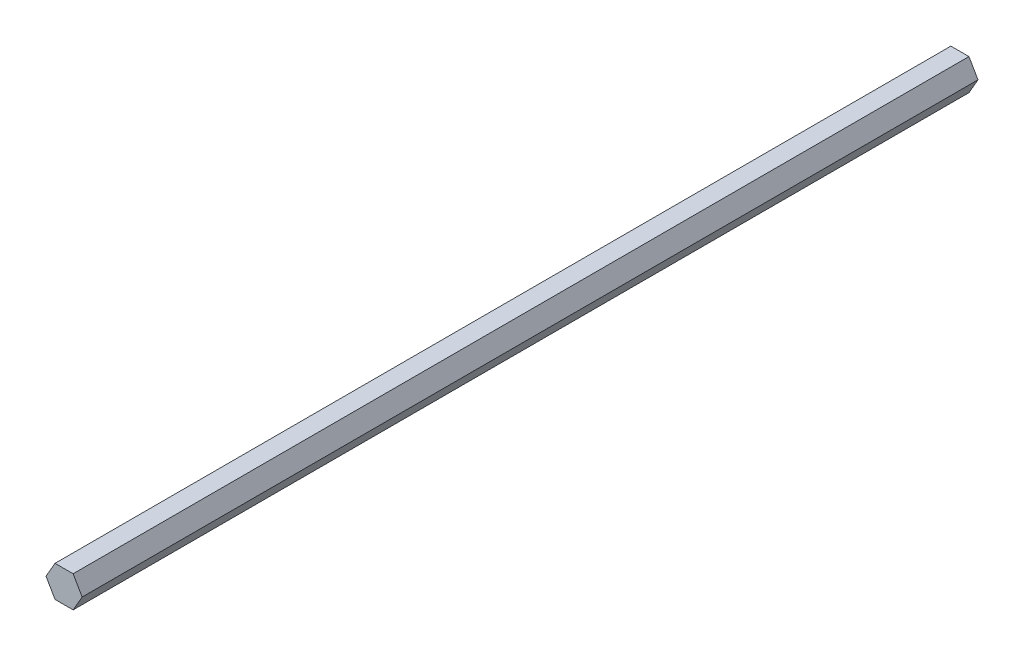
ISO-10303-21;
HEADER;
FILE_DESCRIPTION(('STEP AP214'),'2;1');
FILE_NAME('part.step','',(''),(''),'','','');
FILE_SCHEMA(('AUTOMOTIVE_DESIGN { 1 0 10303 214 1 1 1 1 }'));
ENDSEC;
DATA;
#1=APPLICATION_CONTEXT('core data for automotive mechanical design processes');
#2=APPLICATION_PROTOCOL_DEFINITION('international standard','automotive_design',2000,#1);
#3=PRODUCT_CONTEXT('',#1,'mechanical');
#4=PRODUCT('Part','Part','',(#3));
#5=PRODUCT_RELATED_PRODUCT_CATEGORY('part','',(#4));
#6=PRODUCT_DEFINITION_FORMATION('','',#4);
#7=PRODUCT_DEFINITION_CONTEXT('part definition',#1,'design');
#8=PRODUCT_DEFINITION('design','',#6,#7);
#9=PRODUCT_DEFINITION_SHAPE('','',#8);
#10=(LENGTH_UNIT() NAMED_UNIT(*) SI_UNIT(.MILLI.,.METRE.));
#11=(NAMED_UNIT(*) PLANE_ANGLE_UNIT() SI_UNIT($,.RADIAN.));
#12=(NAMED_UNIT(*) SI_UNIT($,.STERADIAN.) SOLID_ANGLE_UNIT());
#13=UNCERTAINTY_MEASURE_WITH_UNIT(LENGTH_MEASURE(1.E-05),#10,'distance_accuracy_value','');
#14=(GEOMETRIC_REPRESENTATION_CONTEXT(3) GLOBAL_UNCERTAINTY_ASSIGNED_CONTEXT((#13)) GLOBAL_UNIT_ASSIGNED_CONTEXT((#10,
#11,#12)) REPRESENTATION_CONTEXT('',''));
#15=CARTESIAN_POINT('',(0.,0.,0.));
#16=DIRECTION('',(0.,0.,1.));
#17=DIRECTION('',(1.,0.,0.));
#18=AXIS2_PLACEMENT_3D('',#15,#16,#17);
#19=CARTESIAN_POINT('',(3.665,6.34796620973994,363.18));
#20=DIRECTION('',(0.,-1.,0.));
#21=DIRECTION('',(0.,0.,-1.));
#22=AXIS2_PLACEMENT_3D('',#19,#20,#21);
#23=PLANE('',#22);
#24=DIRECTION('',(-1.,0.,0.));
#25=VECTOR('',#24,1.);
#26=CARTESIAN_POINT('',(3.665,6.34796620973994,0.));
#27=LINE('',#26,#25);
#28=CARTESIAN_POINT('',(3.665,6.34796620973994,0.));
#29=VERTEX_POINT('',#28);
#30=CARTESIAN_POINT('',(-3.665,6.34796620973994,0.));
#31=VERTEX_POINT('',#30);
#32=EDGE_CURVE('E117',#29,#31,#27,.T.);
#33=ORIENTED_EDGE('',*,*,#32,.T.);
#34=DIRECTION('',(0.,0.,-1.));
#35=VECTOR('',#34,1.);
#36=CARTESIAN_POINT('',(-3.665,6.34796620973994,363.18));
#37=LINE('',#36,#35);
#38=CARTESIAN_POINT('',(-3.665,6.34796620973994,363.18));
#39=VERTEX_POINT('',#38);
#40=EDGE_CURVE('E11',#39,#31,#37,.T.);
#41=ORIENTED_EDGE('',*,*,#40,.F.);
#42=DIRECTION('',(-1.,0.,0.));
#43=VECTOR('',#42,1.);
#44=CARTESIAN_POINT('',(3.665,6.34796620973994,363.18));
#45=LINE('',#44,#43);
#46=CARTESIAN_POINT('',(3.665,6.34796620973994,363.18));
#47=VERTEX_POINT('',#46);
#48=EDGE_CURVE('E127',#47,#39,#45,.T.);
#49=ORIENTED_EDGE('',*,*,#48,.F.);
#50=DIRECTION('',(0.,0.,-1.));
#51=VECTOR('',#50,1.);
#52=CARTESIAN_POINT('',(3.665,6.34796620973994,363.18));
#53=LINE('',#52,#51);
#54=EDGE_CURVE('E113',#47,#29,#53,.T.);
#55=ORIENTED_EDGE('',*,*,#54,.T.);
#56=EDGE_LOOP('',(#33,#41,#49,#55));
#57=FACE_BOUND('',#56,.T.);
#58=ADVANCED_FACE('F33',(#57),#23,.F.);
#59=CARTESIAN_POINT('',(-3.665,6.34796620973994,363.18));
#60=DIRECTION('',(0.866025403784439,-0.5,0.));
#61=DIRECTION('',(0.5,0.866025403784439,0.));
#62=AXIS2_PLACEMENT_3D('',#59,#60,#61);
#63=PLANE('',#62);
#64=DIRECTION('',(-0.5,-0.866025403784439,0.));
#65=VECTOR('',#64,1.);
#66=CARTESIAN_POINT('',(-3.665,6.34796620973994,0.));
#67=LINE('',#66,#65);
#68=CARTESIAN_POINT('',(-7.33,0.,0.));
#69=VERTEX_POINT('',#68);
#70=EDGE_CURVE('E120',#31,#69,#67,.T.);
#71=ORIENTED_EDGE('',*,*,#70,.T.);
#72=DIRECTION('',(0.,0.,-1.));
#73=VECTOR('',#72,1.);
#74=CARTESIAN_POINT('',(-7.33,0.,363.18));
#75=LINE('',#74,#73);
#76=CARTESIAN_POINT('',(-7.33,0.,363.18));
#77=VERTEX_POINT('',#76);
#78=EDGE_CURVE('E41',#77,#69,#75,.T.);
#79=ORIENTED_EDGE('',*,*,#78,.F.);
#80=DIRECTION('',(-0.5,-0.866025403784439,0.));
#81=VECTOR('',#80,1.);
#82=CARTESIAN_POINT('',(-3.665,6.34796620973994,363.18));
#83=LINE('',#82,#81);
#84=EDGE_CURVE('E86',#39,#77,#83,.T.);
#85=ORIENTED_EDGE('',*,*,#84,.F.);
#86=ORIENTED_EDGE('',*,*,#40,.T.);
#87=EDGE_LOOP('',(#71,#79,#85,#86));
#88=FACE_BOUND('',#87,.T.);
#89=ADVANCED_FACE('F151',(#88),#63,.F.);
#90=CARTESIAN_POINT('',(-7.33,0.,363.18));
#91=DIRECTION('',(0.866025403784439,0.5,0.));
#92=DIRECTION('',(-0.5,0.866025403784439,0.));
#93=AXIS2_PLACEMENT_3D('',#90,#91,#92);
#94=PLANE('',#93);
#95=DIRECTION('',(0.5,-0.866025403784439,0.));
#96=VECTOR('',#95,1.);
#97=CARTESIAN_POINT('',(-7.33,0.,0.));
#98=LINE('',#97,#96);
#99=CARTESIAN_POINT('',(-3.66499999999999,-6.34796620973995,0.));
#100=VERTEX_POINT('',#99);
#101=EDGE_CURVE('E122',#69,#100,#98,.T.);
#102=ORIENTED_EDGE('',*,*,#101,.T.);
#103=DIRECTION('',(0.,0.,-1.));
#104=VECTOR('',#103,1.);
#105=CARTESIAN_POINT('',(-3.66499999999999,-6.34796620973995,363.18));
#106=LINE('',#105,#104);
#107=CARTESIAN_POINT('',(-3.66499999999999,-6.34796620973995,363.18));
#108=VERTEX_POINT('',#107);
#109=EDGE_CURVE('E108',#108,#100,#106,.T.);
#110=ORIENTED_EDGE('',*,*,#109,.F.);
#111=DIRECTION('',(0.5,-0.866025403784439,0.));
#112=VECTOR('',#111,1.);
#113=CARTESIAN_POINT('',(-7.33,0.,363.18));
#114=LINE('',#113,#112);
#115=EDGE_CURVE('E99',#77,#108,#114,.T.);
#116=ORIENTED_EDGE('',*,*,#115,.F.);
#117=ORIENTED_EDGE('',*,*,#78,.T.);
#118=EDGE_LOOP('',(#102,#110,#116,#117));
#119=FACE_BOUND('',#118,.T.);
#120=ADVANCED_FACE('F133',(#119),#94,.F.);
#121=CARTESIAN_POINT('',(-3.66499999999999,-6.34796620973995,363.18));
#122=DIRECTION('',(0.,1.,0.));
#123=DIRECTION('',(0.,0.,1.));
#124=AXIS2_PLACEMENT_3D('',#121,#122,#123);
#125=PLANE('',#124);
#126=DIRECTION('',(1.,0.,0.));
#127=VECTOR('',#126,1.);
#128=CARTESIAN_POINT('',(-3.66499999999999,-6.34796620973995,0.));
#129=LINE('',#128,#127);
#130=CARTESIAN_POINT('',(3.665,-6.34796620973995,0.));
#131=VERTEX_POINT('',#130);
#132=EDGE_CURVE('E107',#100,#131,#129,.T.);
#133=ORIENTED_EDGE('',*,*,#132,.T.);
#134=DIRECTION('',(0.,0.,-1.));
#135=VECTOR('',#134,1.);
#136=CARTESIAN_POINT('',(3.665,-6.34796620973995,363.18));
#137=LINE('',#136,#135);
#138=CARTESIAN_POINT('',(3.665,-6.34796620973995,363.18));
#139=VERTEX_POINT('',#138);
#140=EDGE_CURVE('E104',#139,#131,#137,.T.);
#141=ORIENTED_EDGE('',*,*,#140,.F.);
#142=DIRECTION('',(1.,0.,0.));
#143=VECTOR('',#142,1.);
#144=CARTESIAN_POINT('',(-3.66499999999999,-6.34796620973995,363.18));
#145=LINE('',#144,#143);
#146=EDGE_CURVE('E93',#108,#139,#145,.T.);
#147=ORIENTED_EDGE('',*,*,#146,.F.);
#148=ORIENTED_EDGE('',*,*,#109,.T.);
#149=EDGE_LOOP('',(#133,#141,#147,#148));
#150=FACE_BOUND('',#149,.T.);
#151=ADVANCED_FACE('F105',(#150),#125,.F.);
#152=CARTESIAN_POINT('',(3.665,-6.34796620973995,363.18));
#153=DIRECTION('',(-0.866025403784439,0.5,0.));
#154=DIRECTION('',(-0.5,-0.866025403784439,0.));
#155=AXIS2_PLACEMENT_3D('',#152,#153,#154);
#156=PLANE('',#155);
#157=DIRECTION('',(0.5,0.866025403784439,0.));
#158=VECTOR('',#157,1.);
#159=CARTESIAN_POINT('',(3.665,-6.34796620973995,0.));
#160=LINE('',#159,#158);
#161=CARTESIAN_POINT('',(7.33000000000001,0.,0.));
#162=VERTEX_POINT('',#161);
#163=EDGE_CURVE('E72',#131,#162,#160,.T.);
#164=ORIENTED_EDGE('',*,*,#163,.T.);
#165=DIRECTION('',(0.,0.,-1.));
#166=VECTOR('',#165,1.);
#167=CARTESIAN_POINT('',(7.33000000000001,0.,363.18));
#168=LINE('',#167,#166);
#169=CARTESIAN_POINT('',(7.33000000000001,0.,363.18));
#170=VERTEX_POINT('',#169);
#171=EDGE_CURVE('E109',#170,#162,#168,.T.);
#172=ORIENTED_EDGE('',*,*,#171,.F.);
#173=DIRECTION('',(0.5,0.866025403784439,0.));
#174=VECTOR('',#173,1.);
#175=CARTESIAN_POINT('',(3.665,-6.34796620973995,363.18));
#176=LINE('',#175,#174);
#177=EDGE_CURVE('E97',#139,#170,#176,.T.);
#178=ORIENTED_EDGE('',*,*,#177,.F.);
#179=ORIENTED_EDGE('',*,*,#140,.T.);
#180=EDGE_LOOP('',(#164,#172,#178,#179));
#181=FACE_BOUND('',#180,.T.);
#182=ADVANCED_FACE('F111',(#181),#156,.F.);
#183=CARTESIAN_POINT('',(7.33000000000001,0.,363.18));
#184=DIRECTION('',(-0.866025403784438,-0.500000000000001,0.));
#185=DIRECTION('',(0.500000000000001,-0.866025403784438,0.));
#186=AXIS2_PLACEMENT_3D('',#183,#184,#185);
#187=PLANE('',#186);
#188=DIRECTION('',(-0.5,0.866025403784438,0.));
#189=VECTOR('',#188,1.);
#190=CARTESIAN_POINT('',(7.33000000000001,0.,0.));
#191=LINE('',#190,#189);
#192=EDGE_CURVE('E78',#162,#29,#191,.T.);
#193=ORIENTED_EDGE('',*,*,#192,.T.);
#194=ORIENTED_EDGE('',*,*,#54,.F.);
#195=DIRECTION('',(-0.5,0.866025403784438,0.));
#196=VECTOR('',#195,1.);
#197=CARTESIAN_POINT('',(7.33000000000001,0.,363.18));
#198=LINE('',#197,#196);
#199=EDGE_CURVE('E49',#170,#47,#198,.T.);
#200=ORIENTED_EDGE('',*,*,#199,.F.);
#201=ORIENTED_EDGE('',*,*,#171,.T.);
#202=EDGE_LOOP('',(#193,#194,#200,#201));
#203=FACE_BOUND('',#202,.T.);
#204=ADVANCED_FACE('F140',(#203),#187,.F.);
#205=CARTESIAN_POINT('',(0.,0.,363.18));
#206=DIRECTION('',(0.,0.,1.));
#207=DIRECTION('',(1.,0.,0.));
#208=AXIS2_PLACEMENT_3D('',#205,#206,#207);
#209=PLANE('',#208);
#210=ORIENTED_EDGE('',*,*,#48,.T.);
#211=ORIENTED_EDGE('',*,*,#84,.T.);
#212=ORIENTED_EDGE('',*,*,#115,.T.);
#213=ORIENTED_EDGE('',*,*,#146,.T.);
#214=ORIENTED_EDGE('',*,*,#177,.T.);
#215=ORIENTED_EDGE('',*,*,#199,.T.);
#216=EDGE_LOOP('',(#210,#211,#212,#213,#214,#215));
#217=FACE_BOUND('',#216,.T.);
#218=ADVANCED_FACE('F95',(#217),#209,.T.);
#219=CARTESIAN_POINT('',(0.,0.,0.));
#220=DIRECTION('',(0.,0.,1.));
#221=DIRECTION('',(1.,0.,0.));
#222=AXIS2_PLACEMENT_3D('',#219,#220,#221);
#223=PLANE('',#222);
#224=ORIENTED_EDGE('',*,*,#32,.F.);
#225=ORIENTED_EDGE('',*,*,#192,.F.);
#226=ORIENTED_EDGE('',*,*,#163,.F.);
#227=ORIENTED_EDGE('',*,*,#132,.F.);
#228=ORIENTED_EDGE('',*,*,#101,.F.);
#229=ORIENTED_EDGE('',*,*,#70,.F.);
#230=EDGE_LOOP('',(#224,#225,#226,#227,#228,#229));
#231=FACE_BOUND('',#230,.T.);
#232=ADVANCED_FACE('F136',(#231),#223,.F.);
#233=CLOSED_SHELL('',(#58,#89,#120,#151,#182,#204,#218,#232));
#234=MANIFOLD_SOLID_BREP('B2',#233);
#235=ADVANCED_BREP_SHAPE_REPRESENTATION('',(#18,#234),#14);
#236=SHAPE_DEFINITION_REPRESENTATION(#9,#235);
ENDSEC;
END-ISO-10303-21;
